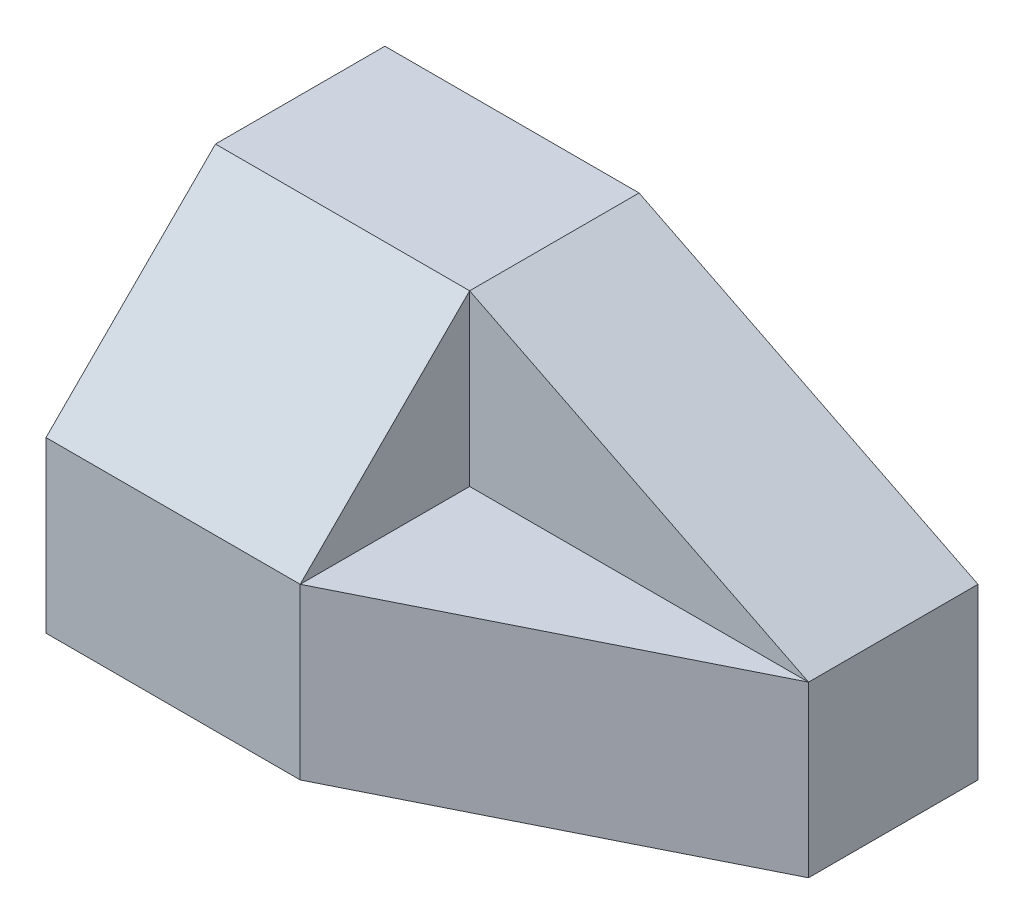
ISO-10303-21;
HEADER;
FILE_DESCRIPTION(('STEP AP214'),'2;1');
FILE_NAME('part.step','',(''),(''),'','','');
FILE_SCHEMA(('AUTOMOTIVE_DESIGN { 1 0 10303 214 1 1 1 1 }'));
ENDSEC;
DATA;
#1=APPLICATION_CONTEXT('core data for automotive mechanical design processes');
#2=APPLICATION_PROTOCOL_DEFINITION('international standard','automotive_design',2000,#1);
#3=PRODUCT_CONTEXT('',#1,'mechanical');
#4=PRODUCT('Part','Part','',(#3));
#5=PRODUCT_RELATED_PRODUCT_CATEGORY('part','',(#4));
#6=PRODUCT_DEFINITION_FORMATION('','',#4);
#7=PRODUCT_DEFINITION_CONTEXT('part definition',#1,'design');
#8=PRODUCT_DEFINITION('design','',#6,#7);
#9=PRODUCT_DEFINITION_SHAPE('','',#8);
#10=(LENGTH_UNIT() NAMED_UNIT(*) SI_UNIT(.MILLI.,.METRE.));
#11=(NAMED_UNIT(*) PLANE_ANGLE_UNIT() SI_UNIT($,.RADIAN.));
#12=(NAMED_UNIT(*) SI_UNIT($,.STERADIAN.) SOLID_ANGLE_UNIT());
#13=UNCERTAINTY_MEASURE_WITH_UNIT(LENGTH_MEASURE(1.E-05),#10,'distance_accuracy_value','');
#14=(GEOMETRIC_REPRESENTATION_CONTEXT(3) GLOBAL_UNCERTAINTY_ASSIGNED_CONTEXT((#13)) GLOBAL_UNIT_ASSIGNED_CONTEXT((#10,
#11,#12)) REPRESENTATION_CONTEXT('',''));
#15=CARTESIAN_POINT('',(0.,0.,0.));
#16=DIRECTION('',(0.,0.,1.));
#17=DIRECTION('',(1.,0.,0.));
#18=AXIS2_PLACEMENT_3D('',#15,#16,#17);
#19=CARTESIAN_POINT('',(3.5,4.,2.));
#20=DIRECTION('',(-1.,0.,0.));
#21=DIRECTION('',(0.,0.,1.));
#22=AXIS2_PLACEMENT_3D('',#19,#20,#21);
#23=PLANE('',#22);
#24=DIRECTION('',(0.,-1.,0.));
#25=VECTOR('',#24,1.);
#26=CARTESIAN_POINT('',(3.5,6.4,0.));
#27=LINE('',#26,#25);
#28=CARTESIAN_POINT('',(3.5,2.,0.));
#29=VERTEX_POINT('',#28);
#30=CARTESIAN_POINT('',(3.5,0.,0.));
#31=VERTEX_POINT('',#30);
#32=EDGE_CURVE('E128',#29,#31,#27,.T.);
#33=ORIENTED_EDGE('',*,*,#32,.T.);
#34=DIRECTION('',(0.,0.,-1.));
#35=VECTOR('',#34,1.);
#36=CARTESIAN_POINT('',(3.5,0.,2.));
#37=LINE('',#36,#35);
#38=CARTESIAN_POINT('',(3.5,0.,-2.));
#39=VERTEX_POINT('',#38);
#40=EDGE_CURVE('E126',#31,#39,#37,.T.);
#41=ORIENTED_EDGE('',*,*,#40,.T.);
#42=DIRECTION('',(0.,-1.,0.));
#43=VECTOR('',#42,1.);
#44=CARTESIAN_POINT('',(3.5,4.,-2.));
#45=LINE('',#44,#43);
#46=CARTESIAN_POINT('',(3.5,2.,-2.));
#47=VERTEX_POINT('',#46);
#48=EDGE_CURVE('E11',#47,#39,#45,.T.);
#49=ORIENTED_EDGE('',*,*,#48,.F.);
#50=DIRECTION('',(0.,0.,1.));
#51=VECTOR('',#50,1.);
#52=CARTESIAN_POINT('',(3.5,2.,-2.));
#53=LINE('',#52,#51);
#54=EDGE_CURVE('E123',#47,#29,#53,.T.);
#55=ORIENTED_EDGE('',*,*,#54,.T.);
#56=EDGE_LOOP('',(#33,#41,#49,#55));
#57=FACE_BOUND('',#56,.T.);
#58=ADVANCED_FACE('F33',(#57),#23,.F.);
#59=CARTESIAN_POINT('',(-3.5,4.,2.));
#60=DIRECTION('',(0.,0.,-1.));
#61=DIRECTION('',(-1.,0.,0.));
#62=AXIS2_PLACEMENT_3D('',#59,#60,#61);
#63=PLANE('',#62);
#64=DIRECTION('',(0.,-1.,0.));
#65=VECTOR('',#64,1.);
#66=CARTESIAN_POINT('',(-0.499999999999997,6.4,2.));
#67=LINE('',#66,#65);
#68=CARTESIAN_POINT('',(-0.499999999999997,2.,2.));
#69=VERTEX_POINT('',#68);
#70=CARTESIAN_POINT('',(-0.499999999999997,0.,2.));
#71=VERTEX_POINT('',#70);
#72=EDGE_CURVE('E160',#69,#71,#67,.T.);
#73=ORIENTED_EDGE('',*,*,#72,.F.);
#74=DIRECTION('',(1.,0.,0.));
#75=VECTOR('',#74,1.);
#76=CARTESIAN_POINT('',(-4.3,2.,2.));
#77=LINE('',#76,#75);
#78=CARTESIAN_POINT('',(-3.5,2.,2.));
#79=VERTEX_POINT('',#78);
#80=EDGE_CURVE('E47',#79,#69,#77,.T.);
#81=ORIENTED_EDGE('',*,*,#80,.F.);
#82=DIRECTION('',(0.,-1.,0.));
#83=VECTOR('',#82,1.);
#84=CARTESIAN_POINT('',(-3.5,4.,2.));
#85=LINE('',#84,#83);
#86=CARTESIAN_POINT('',(-3.5,0.,2.));
#87=VERTEX_POINT('',#86);
#88=EDGE_CURVE('E135',#79,#87,#85,.T.);
#89=ORIENTED_EDGE('',*,*,#88,.T.);
#90=DIRECTION('',(1.,0.,0.));
#91=VECTOR('',#90,1.);
#92=CARTESIAN_POINT('',(-3.5,0.,2.));
#93=LINE('',#92,#91);
#94=EDGE_CURVE('E133',#87,#71,#93,.T.);
#95=ORIENTED_EDGE('',*,*,#94,.T.);
#96=EDGE_LOOP('',(#73,#81,#89,#95));
#97=FACE_BOUND('',#96,.T.);
#98=ADVANCED_FACE('F159',(#97),#63,.F.);
#99=CARTESIAN_POINT('',(0.,0.,0.));
#100=DIRECTION('',(0.,-1.,0.));
#101=DIRECTION('',(0.,0.,-1.));
#102=AXIS2_PLACEMENT_3D('',#99,#100,#101);
#103=PLANE('',#102);
#104=ORIENTED_EDGE('',*,*,#40,.F.);
#105=DIRECTION('',(-0.894427190999916,0.,0.447213595499958));
#106=VECTOR('',#105,1.);
#107=CARTESIAN_POINT('',(3.5,0.,0.));
#108=LINE('',#107,#106);
#109=EDGE_CURVE('E117',#31,#71,#108,.T.);
#110=ORIENTED_EDGE('',*,*,#109,.T.);
#111=ORIENTED_EDGE('',*,*,#94,.F.);
#112=DIRECTION('',(0.,0.,1.));
#113=VECTOR('',#112,1.);
#114=CARTESIAN_POINT('',(-3.5,0.,2.));
#115=LINE('',#114,#113);
#116=CARTESIAN_POINT('',(-3.5,0.,-2.));
#117=VERTEX_POINT('',#116);
#118=EDGE_CURVE('E139',#117,#87,#115,.T.);
#119=ORIENTED_EDGE('',*,*,#118,.F.);
#120=DIRECTION('',(-1.,0.,0.));
#121=VECTOR('',#120,1.);
#122=CARTESIAN_POINT('',(-3.5,0.,-2.));
#123=LINE('',#122,#121);
#124=EDGE_CURVE('E137',#39,#117,#123,.T.);
#125=ORIENTED_EDGE('',*,*,#124,.F.);
#126=EDGE_LOOP('',(#104,#110,#111,#119,#125));
#127=FACE_BOUND('',#126,.T.);
#128=ADVANCED_FACE('F155',(#127),#103,.T.);
#129=CARTESIAN_POINT('',(-0.499999999999997,4.,-2.));
#130=DIRECTION('',(-0.447213595499958,-0.894427190999916,0.));
#131=DIRECTION('',(0.894427190999916,-0.447213595499958,0.));
#132=AXIS2_PLACEMENT_3D('',#129,#130,#131);
#133=PLANE('',#132);
#134=DIRECTION('',(0.,0.,1.));
#135=VECTOR('',#134,1.);
#136=CARTESIAN_POINT('',(-0.499999999999997,4.,-2.));
#137=LINE('',#136,#135);
#138=CARTESIAN_POINT('',(-0.499999999999998,4.,-2.));
#139=VERTEX_POINT('',#138);
#140=CARTESIAN_POINT('',(-0.499999999999997,4.,0.));
#141=VERTEX_POINT('',#140);
#142=EDGE_CURVE('E103',#139,#141,#137,.T.);
#143=ORIENTED_EDGE('',*,*,#142,.T.);
#144=DIRECTION('',(0.894427190999916,-0.447213595499958,0.));
#145=VECTOR('',#144,1.);
#146=CARTESIAN_POINT('',(-0.499999999999998,4.,0.));
#147=LINE('',#146,#145);
#148=EDGE_CURVE('E110',#141,#29,#147,.T.);
#149=ORIENTED_EDGE('',*,*,#148,.T.);
#150=ORIENTED_EDGE('',*,*,#54,.F.);
#151=DIRECTION('',(0.894427190999916,-0.447213595499958,0.));
#152=VECTOR('',#151,1.);
#153=CARTESIAN_POINT('',(-0.499999999999997,4.,-2.));
#154=LINE('',#153,#152);
#155=EDGE_CURVE('E55',#139,#47,#154,.T.);
#156=ORIENTED_EDGE('',*,*,#155,.F.);
#157=EDGE_LOOP('',(#143,#149,#150,#156));
#158=FACE_BOUND('',#157,.T.);
#159=ADVANCED_FACE('F122',(#158),#133,.F.);
#160=CARTESIAN_POINT('',(-3.5,4.,-2.));
#161=DIRECTION('',(0.,0.,1.));
#162=DIRECTION('',(1.,0.,0.));
#163=AXIS2_PLACEMENT_3D('',#160,#161,#162);
#164=PLANE('',#163);
#165=DIRECTION('',(-1.,0.,0.));
#166=VECTOR('',#165,1.);
#167=CARTESIAN_POINT('',(-3.5,4.,-2.));
#168=LINE('',#167,#166);
#169=CARTESIAN_POINT('',(-3.5,4.,-2.));
#170=VERTEX_POINT('',#169);
#171=EDGE_CURVE('E131',#139,#170,#168,.T.);
#172=ORIENTED_EDGE('',*,*,#171,.F.);
#173=ORIENTED_EDGE('',*,*,#155,.T.);
#174=ORIENTED_EDGE('',*,*,#48,.T.);
#175=ORIENTED_EDGE('',*,*,#124,.T.);
#176=DIRECTION('',(0.,-1.,0.));
#177=VECTOR('',#176,1.);
#178=CARTESIAN_POINT('',(-3.5,4.,-2.));
#179=LINE('',#178,#177);
#180=EDGE_CURVE('E40',#170,#117,#179,.T.);
#181=ORIENTED_EDGE('',*,*,#180,.F.);
#182=EDGE_LOOP('',(#172,#173,#174,#175,#181));
#183=FACE_BOUND('',#182,.T.);
#184=ADVANCED_FACE('F199',(#183),#164,.F.);
#185=CARTESIAN_POINT('',(-3.5,4.,2.));
#186=DIRECTION('',(1.,0.,0.));
#187=DIRECTION('',(0.,0.,-1.));
#188=AXIS2_PLACEMENT_3D('',#185,#186,#187);
#189=PLANE('',#188);
#190=ORIENTED_EDGE('',*,*,#88,.F.);
#191=DIRECTION('',(0.,0.707106781186548,-0.707106781186548));
#192=VECTOR('',#191,1.);
#193=CARTESIAN_POINT('',(-3.5,3.,1.));
#194=LINE('',#193,#192);
#195=CARTESIAN_POINT('',(-3.5,4.,0.));
#196=VERTEX_POINT('',#195);
#197=EDGE_CURVE('E161',#79,#196,#194,.T.);
#198=ORIENTED_EDGE('',*,*,#197,.T.);
#199=DIRECTION('',(0.,0.,1.));
#200=VECTOR('',#199,1.);
#201=CARTESIAN_POINT('',(-3.5,4.,2.));
#202=LINE('',#201,#200);
#203=EDGE_CURVE('E106',#170,#196,#202,.T.);
#204=ORIENTED_EDGE('',*,*,#203,.F.);
#205=ORIENTED_EDGE('',*,*,#180,.T.);
#206=ORIENTED_EDGE('',*,*,#118,.T.);
#207=EDGE_LOOP('',(#190,#198,#204,#205,#206));
#208=FACE_BOUND('',#207,.T.);
#209=ADVANCED_FACE('F149',(#208),#189,.F.);
#210=CARTESIAN_POINT('',(0.,4.,0.));
#211=DIRECTION('',(0.,-1.,0.));
#212=DIRECTION('',(0.,0.,-1.));
#213=AXIS2_PLACEMENT_3D('',#210,#211,#212);
#214=PLANE('',#213);
#215=ORIENTED_EDGE('',*,*,#203,.T.);
#216=DIRECTION('',(1.,0.,0.));
#217=VECTOR('',#216,1.);
#218=CARTESIAN_POINT('',(-4.3,4.,0.));
#219=LINE('',#218,#217);
#220=EDGE_CURVE('E92',#196,#141,#219,.T.);
#221=ORIENTED_EDGE('',*,*,#220,.T.);
#222=ORIENTED_EDGE('',*,*,#142,.F.);
#223=ORIENTED_EDGE('',*,*,#171,.T.);
#224=EDGE_LOOP('',(#215,#221,#222,#223));
#225=FACE_BOUND('',#224,.T.);
#226=ADVANCED_FACE('F102',(#225),#214,.F.);
#227=CARTESIAN_POINT('',(3.5,6.4,0.));
#228=DIRECTION('',(0.447213595499958,0.,0.894427190999916));
#229=DIRECTION('',(0.894427190999916,0.,-0.447213595499958));
#230=AXIS2_PLACEMENT_3D('',#227,#228,#229);
#231=PLANE('',#230);
#232=DIRECTION('',(0.894427190999916,0.,-0.447213595499958));
#233=VECTOR('',#232,1.);
#234=CARTESIAN_POINT('',(-0.499999999999997,2.,2.));
#235=LINE('',#234,#233);
#236=EDGE_CURVE('E162',#69,#29,#235,.T.);
#237=ORIENTED_EDGE('',*,*,#236,.F.);
#238=ORIENTED_EDGE('',*,*,#72,.T.);
#239=ORIENTED_EDGE('',*,*,#109,.F.);
#240=ORIENTED_EDGE('',*,*,#32,.F.);
#241=EDGE_LOOP('',(#237,#238,#239,#240));
#242=FACE_BOUND('',#241,.T.);
#243=ADVANCED_FACE('F176',(#242),#231,.T.);
#244=CARTESIAN_POINT('',(3.5,2.,0.));
#245=DIRECTION('',(0.,0.,-1.));
#246=DIRECTION('',(-1.,0.,0.));
#247=AXIS2_PLACEMENT_3D('',#244,#245,#246);
#248=PLANE('',#247);
#249=DIRECTION('',(0.,1.,0.));
#250=VECTOR('',#249,1.);
#251=CARTESIAN_POINT('',(-0.499999999999997,2.,0.));
#252=LINE('',#251,#250);
#253=CARTESIAN_POINT('',(-0.499999999999997,2.,0.));
#254=VERTEX_POINT('',#253);
#255=EDGE_CURVE('E112',#254,#141,#252,.T.);
#256=ORIENTED_EDGE('',*,*,#255,.F.);
#257=DIRECTION('',(-1.,0.,0.));
#258=VECTOR('',#257,1.);
#259=CARTESIAN_POINT('',(3.5,2.,0.));
#260=LINE('',#259,#258);
#261=EDGE_CURVE('E114',#29,#254,#260,.T.);
#262=ORIENTED_EDGE('',*,*,#261,.F.);
#263=ORIENTED_EDGE('',*,*,#148,.F.);
#264=EDGE_LOOP('',(#256,#262,#263));
#265=FACE_BOUND('',#264,.T.);
#266=ADVANCED_FACE('F111',(#265),#248,.F.);
#267=CARTESIAN_POINT('',(-0.499999999999997,2.,0.));
#268=DIRECTION('',(-1.,0.,0.));
#269=DIRECTION('',(0.,0.,1.));
#270=AXIS2_PLACEMENT_3D('',#267,#268,#269);
#271=PLANE('',#270);
#272=ORIENTED_EDGE('',*,*,#255,.T.);
#273=DIRECTION('',(0.,0.707106781186548,-0.707106781186548));
#274=VECTOR('',#273,1.);
#275=CARTESIAN_POINT('',(-0.499999999999997,2.,2.));
#276=LINE('',#275,#274);
#277=EDGE_CURVE('E89',#69,#141,#276,.T.);
#278=ORIENTED_EDGE('',*,*,#277,.F.);
#279=DIRECTION('',(0.,0.,1.));
#280=VECTOR('',#279,1.);
#281=CARTESIAN_POINT('',(-0.499999999999997,2.,0.));
#282=LINE('',#281,#280);
#283=EDGE_CURVE('E120',#254,#69,#282,.T.);
#284=ORIENTED_EDGE('',*,*,#283,.F.);
#285=EDGE_LOOP('',(#272,#278,#284));
#286=FACE_BOUND('',#285,.T.);
#287=ADVANCED_FACE('F119',(#286),#271,.F.);
#288=CARTESIAN_POINT('',(0.,2.,0.));
#289=DIRECTION('',(0.,-1.,0.));
#290=DIRECTION('',(0.,0.,-1.));
#291=AXIS2_PLACEMENT_3D('',#288,#289,#290);
#292=PLANE('',#291);
#293=ORIENTED_EDGE('',*,*,#236,.T.);
#294=ORIENTED_EDGE('',*,*,#261,.T.);
#295=ORIENTED_EDGE('',*,*,#283,.T.);
#296=EDGE_LOOP('',(#293,#294,#295));
#297=FACE_BOUND('',#296,.T.);
#298=ADVANCED_FACE('F178',(#297),#292,.F.);
#299=CARTESIAN_POINT('',(-4.3,2.,2.));
#300=DIRECTION('',(0.,-0.707106781186547,-0.707106781186547));
#301=DIRECTION('',(0.,0.707106781186548,-0.707106781186548));
#302=AXIS2_PLACEMENT_3D('',#299,#300,#301);
#303=PLANE('',#302);
#304=ORIENTED_EDGE('',*,*,#80,.T.);
#305=ORIENTED_EDGE('',*,*,#277,.T.);
#306=ORIENTED_EDGE('',*,*,#220,.F.);
#307=ORIENTED_EDGE('',*,*,#197,.F.);
#308=EDGE_LOOP('',(#304,#305,#306,#307));
#309=FACE_BOUND('',#308,.T.);
#310=ADVANCED_FACE('F91',(#309),#303,.F.);
#311=CLOSED_SHELL('',(#58,#98,#128,#159,#184,#209,#226,#243,#266,#287,#298,#310));
#312=MANIFOLD_SOLID_BREP('B2',#311);
#313=ADVANCED_BREP_SHAPE_REPRESENTATION('',(#18,#312),#14);
#314=SHAPE_DEFINITION_REPRESENTATION(#9,#313);
ENDSEC;
END-ISO-10303-21;
